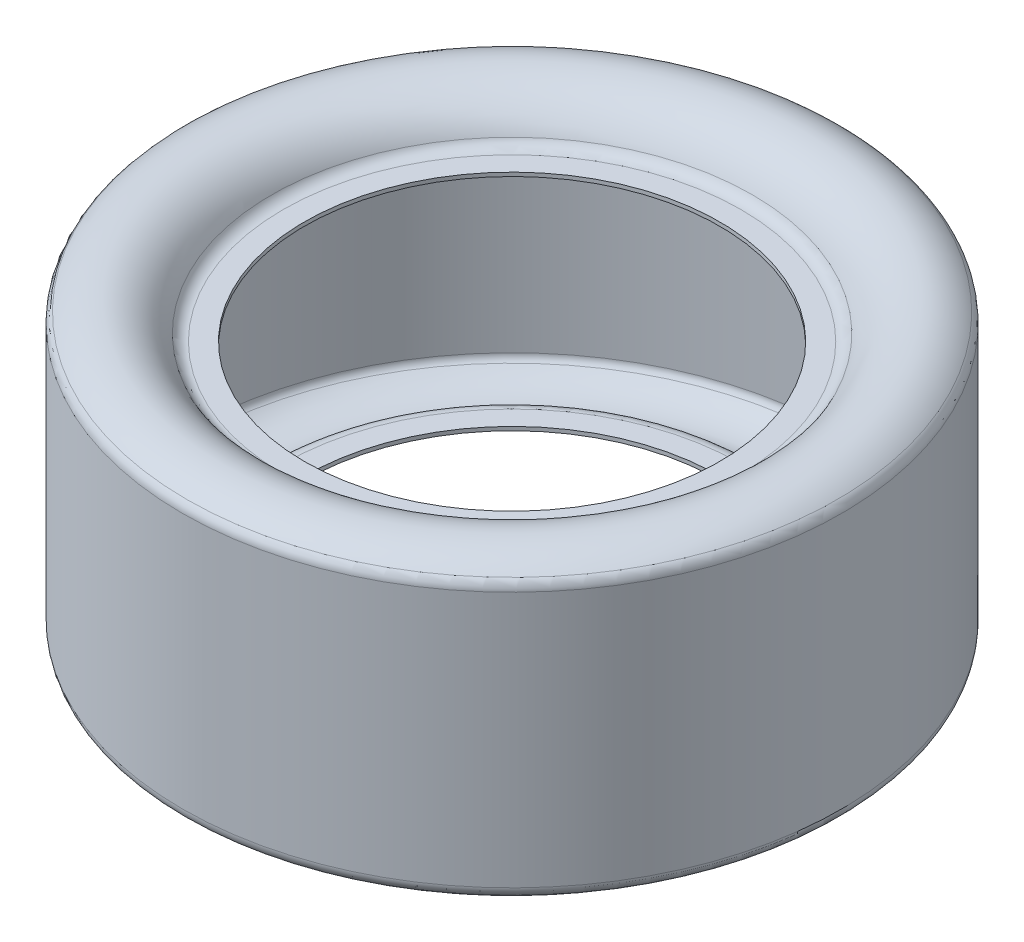
ISO-10303-21;
HEADER;
FILE_DESCRIPTION(('STEP AP214'),'2;1');
FILE_NAME('part.step','',(''),(''),'','','');
FILE_SCHEMA(('AUTOMOTIVE_DESIGN { 1 0 10303 214 1 1 1 1 }'));
ENDSEC;
DATA;
#1=APPLICATION_CONTEXT('core data for automotive mechanical design processes');
#2=APPLICATION_PROTOCOL_DEFINITION('international standard','automotive_design',2000,#1);
#3=PRODUCT_CONTEXT('',#1,'mechanical');
#4=PRODUCT('Part','Part','',(#3));
#5=PRODUCT_RELATED_PRODUCT_CATEGORY('part','',(#4));
#6=PRODUCT_DEFINITION_FORMATION('','',#4);
#7=PRODUCT_DEFINITION_CONTEXT('part definition',#1,'design');
#8=PRODUCT_DEFINITION('design','',#6,#7);
#9=PRODUCT_DEFINITION_SHAPE('','',#8);
#10=(LENGTH_UNIT() NAMED_UNIT(*) SI_UNIT(.MILLI.,.METRE.));
#11=(NAMED_UNIT(*) PLANE_ANGLE_UNIT() SI_UNIT($,.RADIAN.));
#12=(NAMED_UNIT(*) SI_UNIT($,.STERADIAN.) SOLID_ANGLE_UNIT());
#13=UNCERTAINTY_MEASURE_WITH_UNIT(LENGTH_MEASURE(1.E-05),#10,'distance_accuracy_value','');
#14=(GEOMETRIC_REPRESENTATION_CONTEXT(3) GLOBAL_UNCERTAINTY_ASSIGNED_CONTEXT((#13)) GLOBAL_UNIT_ASSIGNED_CONTEXT((#10,
#11,#12)) REPRESENTATION_CONTEXT('',''));
#15=CARTESIAN_POINT('',(0.,0.,0.));
#16=DIRECTION('',(0.,0.,1.));
#17=DIRECTION('',(1.,0.,0.));
#18=AXIS2_PLACEMENT_3D('',#15,#16,#17);
#19=CARTESIAN_POINT('',(0.,-50.8,0.));
#20=DIRECTION('',(0.,1.,0.));
#21=DIRECTION('',(0.,0.,1.));
#22=AXIS2_PLACEMENT_3D('',#19,#20,#21);
#23=CYLINDRICAL_SURFACE('',#22,258.62);
#24=CARTESIAN_POINT('',(0.,-101.6,0.));
#25=DIRECTION('',(0.,1.,0.));
#26=DIRECTION('',(0.,0.,1.));
#27=AXIS2_PLACEMENT_3D('',#24,#25,#26);
#28=CIRCLE('',#27,258.62);
#29=CARTESIAN_POINT('',(0.,-101.6,258.62));
#30=VERTEX_POINT('',#29);
#31=EDGE_CURVE('E241',#30,#30,#28,.F.);
#32=ORIENTED_EDGE('',*,*,#31,.T.);
#33=EDGE_LOOP('',(#32));
#34=FACE_BOUND('',#33,.T.);
#35=CARTESIAN_POINT('',(0.,101.6,0.));
#36=DIRECTION('',(0.,1.,0.));
#37=DIRECTION('',(0.,0.,1.));
#38=AXIS2_PLACEMENT_3D('',#35,#36,#37);
#39=CIRCLE('',#38,258.62);
#40=CARTESIAN_POINT('',(0.,101.6,258.62));
#41=VERTEX_POINT('',#40);
#42=EDGE_CURVE('E238',#41,#41,#39,.T.);
#43=ORIENTED_EDGE('',*,*,#42,.T.);
#44=EDGE_LOOP('',(#43));
#45=FACE_BOUND('',#44,.T.);
#46=ADVANCED_FACE('F14',(#34,#45),#23,.F.);
#47=CARTESIAN_POINT('',(0.,-101.6,0.));
#48=DIRECTION('',(0.,1.,0.));
#49=DIRECTION('',(0.,0.,1.));
#50=AXIS2_PLACEMENT_3D('',#47,#48,#49);
#51=TOROIDAL_SURFACE('',#50,251.62,6.9999999999999);
#52=ORIENTED_EDGE('',*,*,#31,.F.);
#53=EDGE_LOOP('',(#52));
#54=FACE_BOUND('',#53,.T.);
#55=CARTESIAN_POINT('',(0.,-106.98241227044,0.));
#56=DIRECTION('',(0.,1.,0.));
#57=DIRECTION('',(0.,0.,1.));
#58=AXIS2_PLACEMENT_3D('',#55,#56,#57);
#59=CIRCLE('',#58,256.095448374299);
#60=CARTESIAN_POINT('',(0.,-106.98241227044,256.095448374299));
#61=VERTEX_POINT('',#60);
#62=EDGE_CURVE('E219',#61,#61,#59,.F.);
#63=ORIENTED_EDGE('',*,*,#62,.T.);
#64=EDGE_LOOP('',(#63));
#65=FACE_BOUND('',#64,.T.);
#66=ADVANCED_FACE('F232',(#54,#65),#51,.F.);
#67=CARTESIAN_POINT('',(0.,101.6,0.));
#68=DIRECTION('',(0.,1.,0.));
#69=DIRECTION('',(0.,0.,1.));
#70=AXIS2_PLACEMENT_3D('',#67,#68,#69);
#71=TOROIDAL_SURFACE('',#70,251.62,6.9999999999999);
#72=CARTESIAN_POINT('',(0.,106.98241227044,0.));
#73=DIRECTION('',(0.,1.,0.));
#74=DIRECTION('',(0.,0.,1.));
#75=AXIS2_PLACEMENT_3D('',#72,#73,#74);
#76=CIRCLE('',#75,256.095448374299);
#77=CARTESIAN_POINT('',(0.,106.98241227044,256.095448374299));
#78=VERTEX_POINT('',#77);
#79=EDGE_CURVE('E216',#78,#78,#76,.T.);
#80=ORIENTED_EDGE('',*,*,#79,.T.);
#81=EDGE_LOOP('',(#80));
#82=FACE_BOUND('',#81,.T.);
#83=ORIENTED_EDGE('',*,*,#42,.F.);
#84=EDGE_LOOP('',(#83));
#85=FACE_BOUND('',#84,.T.);
#86=ADVANCED_FACE('F228',(#82,#85),#71,.F.);
#87=CARTESIAN_POINT('',(0.,-75.7125833864919,0.));
#88=DIRECTION('',(0.,1.,0.));
#89=DIRECTION('',(0.,0.,1.));
#90=AXIS2_PLACEMENT_3D('',#87,#88,#89);
#91=TOROIDAL_SURFACE('',#90,230.094745007174,40.667416613508);
#92=ORIENTED_EDGE('',*,*,#62,.F.);
#93=EDGE_LOOP('',(#92));
#94=FACE_BOUND('',#93,.T.);
#95=CARTESIAN_POINT('',(0.,-93.2832508625029,0.));
#96=DIRECTION('',(0.,1.,0.));
#97=DIRECTION('',(0.,0.,1.));
#98=AXIS2_PLACEMENT_3D('',#95,#96,#97);
#99=CIRCLE('',#98,193.418998000956);
#100=CARTESIAN_POINT('',(0.,-93.2832508625029,193.418998000956));
#101=VERTEX_POINT('',#100);
#102=EDGE_CURVE('E180',#101,#101,#99,.T.);
#103=ORIENTED_EDGE('',*,*,#102,.F.);
#104=EDGE_LOOP('',(#103));
#105=FACE_BOUND('',#104,.T.);
#106=ADVANCED_FACE('F225',(#94,#105),#91,.F.);
#107=CARTESIAN_POINT('',(0.,75.712583386492,0.));
#108=DIRECTION('',(0.,1.,0.));
#109=DIRECTION('',(0.,0.,1.));
#110=AXIS2_PLACEMENT_3D('',#107,#108,#109);
#111=TOROIDAL_SURFACE('',#110,230.094745007174,40.667416613508);
#112=CARTESIAN_POINT('',(0.,93.283250862503,0.));
#113=DIRECTION('',(0.,1.,0.));
#114=DIRECTION('',(0.,0.,1.));
#115=AXIS2_PLACEMENT_3D('',#112,#113,#114);
#116=CIRCLE('',#115,193.418998000956);
#117=CARTESIAN_POINT('',(0.,93.283250862503,193.418998000956));
#118=VERTEX_POINT('',#117);
#119=EDGE_CURVE('E176',#118,#118,#116,.F.);
#120=ORIENTED_EDGE('',*,*,#119,.F.);
#121=EDGE_LOOP('',(#120));
#122=FACE_BOUND('',#121,.T.);
#123=ORIENTED_EDGE('',*,*,#79,.F.);
#124=EDGE_LOOP('',(#123));
#125=FACE_BOUND('',#124,.T.);
#126=ADVANCED_FACE('F200',(#122,#125),#111,.F.);
#127=CARTESIAN_POINT('',(0.,-98.9,0.));
#128=DIRECTION('',(0.,1.,0.));
#129=DIRECTION('',(0.,0.,1.));
#130=AXIS2_PLACEMENT_3D('',#127,#128,#129);
#131=TOROIDAL_SURFACE('',#130,181.695,13.0000000000001);
#132=ORIENTED_EDGE('',*,*,#102,.T.);
#133=EDGE_LOOP('',(#132));
#134=FACE_BOUND('',#133,.T.);
#135=CARTESIAN_POINT('',(0.,-85.8999999999999,0.));
#136=DIRECTION('',(0.,-1.,0.));
#137=DIRECTION('',(0.,0.,-1.));
#138=AXIS2_PLACEMENT_3D('',#135,#136,#137);
#139=CIRCLE('',#138,181.695000000036);
#140=CARTESIAN_POINT('',(0.,-85.8999999999999,-181.695000000036));
#141=VERTEX_POINT('',#140);
#142=EDGE_CURVE('E179',#141,#141,#139,.F.);
#143=ORIENTED_EDGE('',*,*,#142,.F.);
#144=EDGE_LOOP('',(#143));
#145=FACE_BOUND('',#144,.T.);
#146=ADVANCED_FACE('F196',(#134,#145),#131,.T.);
#147=CARTESIAN_POINT('',(0.,98.9,0.));
#148=DIRECTION('',(0.,1.,0.));
#149=DIRECTION('',(0.,0.,1.));
#150=AXIS2_PLACEMENT_3D('',#147,#148,#149);
#151=TOROIDAL_SURFACE('',#150,181.695,13.0000000000001);
#152=CARTESIAN_POINT('',(0.,85.8999999999999,0.));
#153=DIRECTION('',(0.,1.,0.));
#154=DIRECTION('',(0.,0.,-1.));
#155=AXIS2_PLACEMENT_3D('',#152,#153,#154);
#156=CIRCLE('',#155,181.695000000036);
#157=CARTESIAN_POINT('',(0.,85.8999999999999,-181.695000000036));
#158=VERTEX_POINT('',#157);
#159=EDGE_CURVE('E140',#158,#158,#156,.F.);
#160=ORIENTED_EDGE('',*,*,#159,.F.);
#161=EDGE_LOOP('',(#160));
#162=FACE_BOUND('',#161,.T.);
#163=ORIENTED_EDGE('',*,*,#119,.T.);
#164=EDGE_LOOP('',(#163));
#165=FACE_BOUND('',#164,.T.);
#166=ADVANCED_FACE('F162',(#162,#165),#151,.T.);
#167=CARTESIAN_POINT('',(0.,-85.8999999999999,-164.825));
#168=DIRECTION('',(0.,1.,0.));
#169=DIRECTION('',(0.,0.,1.));
#170=AXIS2_PLACEMENT_3D('',#167,#168,#169);
#171=PLANE('',#170);
#172=CARTESIAN_POINT('',(0.,-85.8999999999999,0.));
#173=DIRECTION('',(0.,1.,0.));
#174=DIRECTION('',(0.,0.,1.));
#175=AXIS2_PLACEMENT_3D('',#172,#173,#174);
#176=CIRCLE('',#175,164.825);
#177=CARTESIAN_POINT('',(0.,-85.8999999999999,164.825));
#178=VERTEX_POINT('',#177);
#179=EDGE_CURVE('E17',#178,#178,#176,.F.);
#180=ORIENTED_EDGE('',*,*,#179,.T.);
#181=EDGE_LOOP('',(#180));
#182=FACE_BOUND('',#181,.T.);
#183=ORIENTED_EDGE('',*,*,#142,.T.);
#184=EDGE_LOOP('',(#183));
#185=FACE_BOUND('',#184,.T.);
#186=ADVANCED_FACE('F157',(#182,#185),#171,.T.);
#187=CARTESIAN_POINT('',(0.,85.9,-181.695000000036));
#188=DIRECTION('',(0.,-1.,0.));
#189=DIRECTION('',(0.,0.,-1.));
#190=AXIS2_PLACEMENT_3D('',#187,#188,#189);
#191=PLANE('',#190);
#192=CARTESIAN_POINT('',(0.,85.8999999999999,0.));
#193=DIRECTION('',(0.,1.,0.));
#194=DIRECTION('',(0.,0.,1.));
#195=AXIS2_PLACEMENT_3D('',#192,#193,#194);
#196=CIRCLE('',#195,164.825);
#197=CARTESIAN_POINT('',(0.,85.8999999999999,164.825));
#198=VERTEX_POINT('',#197);
#199=EDGE_CURVE('E254',#198,#198,#196,.T.);
#200=ORIENTED_EDGE('',*,*,#199,.T.);
#201=EDGE_LOOP('',(#200));
#202=FACE_BOUND('',#201,.T.);
#203=ORIENTED_EDGE('',*,*,#159,.T.);
#204=EDGE_LOOP('',(#203));
#205=FACE_BOUND('',#204,.T.);
#206=ADVANCED_FACE('F147',(#202,#205),#191,.T.);
#207=CARTESIAN_POINT('',(0.,-87.3999999999999,0.));
#208=DIRECTION('',(0.,1.,0.));
#209=DIRECTION('',(0.,0.,1.));
#210=AXIS2_PLACEMENT_3D('',#207,#208,#209);
#211=CYLINDRICAL_SURFACE('',#210,164.825);
#212=ORIENTED_EDGE('',*,*,#179,.F.);
#213=EDGE_LOOP('',(#212));
#214=FACE_BOUND('',#213,.T.);
#215=CARTESIAN_POINT('',(0.,-88.9,0.));
#216=DIRECTION('',(0.,1.,0.));
#217=DIRECTION('',(0.,0.,1.));
#218=AXIS2_PLACEMENT_3D('',#215,#216,#217);
#219=CIRCLE('',#218,164.825);
#220=CARTESIAN_POINT('',(0.,-88.9,164.825));
#221=VERTEX_POINT('',#220);
#222=EDGE_CURVE('E252',#221,#221,#219,.T.);
#223=ORIENTED_EDGE('',*,*,#222,.F.);
#224=EDGE_LOOP('',(#223));
#225=FACE_BOUND('',#224,.T.);
#226=ADVANCED_FACE('F156',(#214,#225),#211,.F.);
#227=CARTESIAN_POINT('',(0.,87.3999999999999,0.));
#228=DIRECTION('',(0.,1.,0.));
#229=DIRECTION('',(0.,0.,1.));
#230=AXIS2_PLACEMENT_3D('',#227,#228,#229);
#231=CYLINDRICAL_SURFACE('',#230,164.825);
#232=CARTESIAN_POINT('',(0.,88.9,0.));
#233=DIRECTION('',(0.,1.,0.));
#234=DIRECTION('',(0.,0.,1.));
#235=AXIS2_PLACEMENT_3D('',#232,#233,#234);
#236=CIRCLE('',#235,164.825);
#237=CARTESIAN_POINT('',(0.,88.9,164.825));
#238=VERTEX_POINT('',#237);
#239=EDGE_CURVE('E249',#238,#238,#236,.F.);
#240=ORIENTED_EDGE('',*,*,#239,.F.);
#241=EDGE_LOOP('',(#240));
#242=FACE_BOUND('',#241,.T.);
#243=ORIENTED_EDGE('',*,*,#199,.F.);
#244=EDGE_LOOP('',(#243));
#245=FACE_BOUND('',#244,.T.);
#246=ADVANCED_FACE('F110',(#242,#245),#231,.F.);
#247=CARTESIAN_POINT('',(0.,-88.9,-181.695));
#248=DIRECTION('',(0.,-1.,0.));
#249=DIRECTION('',(0.,0.,-1.));
#250=AXIS2_PLACEMENT_3D('',#247,#248,#249);
#251=PLANE('',#250);
#252=ORIENTED_EDGE('',*,*,#222,.T.);
#253=EDGE_LOOP('',(#252));
#254=FACE_BOUND('',#253,.T.);
#255=CARTESIAN_POINT('',(0.,-88.9,0.));
#256=DIRECTION('',(0.,1.,0.));
#257=DIRECTION('',(0.,0.,-1.));
#258=AXIS2_PLACEMENT_3D('',#255,#256,#257);
#259=CIRCLE('',#258,181.695);
#260=CARTESIAN_POINT('',(0.,-88.9,-181.695));
#261=VERTEX_POINT('',#260);
#262=EDGE_CURVE('E127',#261,#261,#259,.F.);
#263=ORIENTED_EDGE('',*,*,#262,.T.);
#264=EDGE_LOOP('',(#263));
#265=FACE_BOUND('',#264,.T.);
#266=ADVANCED_FACE('F105',(#254,#265),#251,.T.);
#267=CARTESIAN_POINT('',(0.,88.9,-164.825));
#268=DIRECTION('',(0.,1.,0.));
#269=DIRECTION('',(0.,0.,1.));
#270=AXIS2_PLACEMENT_3D('',#267,#268,#269);
#271=PLANE('',#270);
#272=ORIENTED_EDGE('',*,*,#239,.T.);
#273=EDGE_LOOP('',(#272));
#274=FACE_BOUND('',#273,.T.);
#275=CARTESIAN_POINT('',(0.,88.9,0.));
#276=DIRECTION('',(0.,-1.,0.));
#277=DIRECTION('',(0.,0.,-1.));
#278=AXIS2_PLACEMENT_3D('',#275,#276,#277);
#279=CIRCLE('',#278,181.695);
#280=CARTESIAN_POINT('',(0.,88.9,-181.695));
#281=VERTEX_POINT('',#280);
#282=EDGE_CURVE('E92',#281,#281,#279,.F.);
#283=ORIENTED_EDGE('',*,*,#282,.T.);
#284=EDGE_LOOP('',(#283));
#285=FACE_BOUND('',#284,.T.);
#286=ADVANCED_FACE('F96',(#274,#285),#271,.T.);
#287=CARTESIAN_POINT('',(0.,-98.9,0.));
#288=DIRECTION('',(0.,1.,0.));
#289=DIRECTION('',(0.,0.,1.));
#290=AXIS2_PLACEMENT_3D('',#287,#288,#289);
#291=TOROIDAL_SURFACE('',#290,181.695,10.);
#292=ORIENTED_EDGE('',*,*,#262,.F.);
#293=EDGE_LOOP('',(#292));
#294=FACE_BOUND('',#293,.T.);
#295=CARTESIAN_POINT('',(0.,-94.5794237403871,0.));
#296=DIRECTION('',(0.,1.,0.));
#297=DIRECTION('',(0.,0.,1.));
#298=AXIS2_PLACEMENT_3D('',#295,#296,#297);
#299=CIRCLE('',#298,190.713460000736);
#300=CARTESIAN_POINT('',(0.,-94.5794237403871,190.713460000736));
#301=VERTEX_POINT('',#300);
#302=EDGE_CURVE('E63',#301,#301,#299,.T.);
#303=ORIENTED_EDGE('',*,*,#302,.F.);
#304=EDGE_LOOP('',(#303));
#305=FACE_BOUND('',#304,.T.);
#306=ADVANCED_FACE('F78',(#294,#305),#291,.F.);
#307=CARTESIAN_POINT('',(0.,98.9,0.));
#308=DIRECTION('',(0.,1.,0.));
#309=DIRECTION('',(0.,0.,1.));
#310=AXIS2_PLACEMENT_3D('',#307,#308,#309);
#311=TOROIDAL_SURFACE('',#310,181.695,10.);
#312=CARTESIAN_POINT('',(0.,94.5794237403872,0.));
#313=DIRECTION('',(0.,1.,0.));
#314=DIRECTION('',(0.,0.,1.));
#315=AXIS2_PLACEMENT_3D('',#312,#313,#314);
#316=CIRCLE('',#315,190.713460000736);
#317=CARTESIAN_POINT('',(0.,94.5794237403872,190.713460000736));
#318=VERTEX_POINT('',#317);
#319=EDGE_CURVE('E57',#318,#318,#316,.F.);
#320=ORIENTED_EDGE('',*,*,#319,.F.);
#321=EDGE_LOOP('',(#320));
#322=FACE_BOUND('',#321,.T.);
#323=ORIENTED_EDGE('',*,*,#282,.F.);
#324=EDGE_LOOP('',(#323));
#325=FACE_BOUND('',#324,.T.);
#326=ADVANCED_FACE('F72',(#322,#325),#311,.F.);
#327=CARTESIAN_POINT('',(0.,-75.7125833864919,0.));
#328=DIRECTION('',(0.,1.,0.));
#329=DIRECTION('',(0.,0.,1.));
#330=AXIS2_PLACEMENT_3D('',#327,#328,#329);
#331=TOROIDAL_SURFACE('',#330,230.094745007174,43.667416613508);
#332=ORIENTED_EDGE('',*,*,#302,.T.);
#333=EDGE_LOOP('',(#332));
#334=FACE_BOUND('',#333,.T.);
#335=CARTESIAN_POINT('',(0.,-109.289160386343,0.));
#336=DIRECTION('',(0.,1.,0.));
#337=DIRECTION('',(0.,0.,1.));
#338=AXIS2_PLACEMENT_3D('',#335,#336,#337);
#339=CIRCLE('',#338,258.01349767757);
#340=CARTESIAN_POINT('',(0.,-109.289160386343,258.01349767757));
#341=VERTEX_POINT('',#340);
#342=EDGE_CURVE('E54',#341,#341,#339,.T.);
#343=ORIENTED_EDGE('',*,*,#342,.F.);
#344=EDGE_LOOP('',(#343));
#345=FACE_BOUND('',#344,.T.);
#346=ADVANCED_FACE('F69',(#334,#345),#331,.T.);
#347=CARTESIAN_POINT('',(0.,75.712583386492,0.));
#348=DIRECTION('',(0.,1.,0.));
#349=DIRECTION('',(0.,0.,1.));
#350=AXIS2_PLACEMENT_3D('',#347,#348,#349);
#351=TOROIDAL_SURFACE('',#350,230.094745007174,43.667416613508);
#352=CARTESIAN_POINT('',(0.,109.289160386343,0.));
#353=DIRECTION('',(0.,1.,0.));
#354=DIRECTION('',(0.,0.,1.));
#355=AXIS2_PLACEMENT_3D('',#352,#353,#354);
#356=CIRCLE('',#355,258.01349767757);
#357=CARTESIAN_POINT('',(0.,109.289160386343,258.01349767757));
#358=VERTEX_POINT('',#357);
#359=EDGE_CURVE('E26',#358,#358,#356,.F.);
#360=ORIENTED_EDGE('',*,*,#359,.F.);
#361=EDGE_LOOP('',(#360));
#362=FACE_BOUND('',#361,.T.);
#363=ORIENTED_EDGE('',*,*,#319,.T.);
#364=EDGE_LOOP('',(#363));
#365=FACE_BOUND('',#364,.T.);
#366=ADVANCED_FACE('F47',(#362,#365),#351,.T.);
#367=CARTESIAN_POINT('',(0.,-101.6,0.));
#368=DIRECTION('',(0.,1.,0.));
#369=DIRECTION('',(0.,0.,1.));
#370=AXIS2_PLACEMENT_3D('',#367,#368,#369);
#371=TOROIDAL_SURFACE('',#370,251.62,10.);
#372=ORIENTED_EDGE('',*,*,#342,.T.);
#373=EDGE_LOOP('',(#372));
#374=FACE_BOUND('',#373,.T.);
#375=CARTESIAN_POINT('',(0.,-101.6,0.));
#376=DIRECTION('',(0.,1.,0.));
#377=DIRECTION('',(0.,0.,1.));
#378=AXIS2_PLACEMENT_3D('',#375,#376,#377);
#379=CIRCLE('',#378,261.62);
#380=CARTESIAN_POINT('',(0.,-101.6,261.62));
#381=VERTEX_POINT('',#380);
#382=EDGE_CURVE('E21',#381,#381,#379,.T.);
#383=ORIENTED_EDGE('',*,*,#382,.F.);
#384=EDGE_LOOP('',(#383));
#385=FACE_BOUND('',#384,.T.);
#386=ADVANCED_FACE('F42',(#374,#385),#371,.T.);
#387=CARTESIAN_POINT('',(0.,101.6,0.));
#388=DIRECTION('',(0.,1.,0.));
#389=DIRECTION('',(0.,0.,1.));
#390=AXIS2_PLACEMENT_3D('',#387,#388,#389);
#391=TOROIDAL_SURFACE('',#390,251.62,10.);
#392=CARTESIAN_POINT('',(0.,101.6,0.));
#393=DIRECTION('',(0.,1.,0.));
#394=DIRECTION('',(0.,0.,1.));
#395=AXIS2_PLACEMENT_3D('',#392,#393,#394);
#396=CIRCLE('',#395,261.62);
#397=CARTESIAN_POINT('',(0.,101.6,261.62));
#398=VERTEX_POINT('',#397);
#399=EDGE_CURVE('E10',#398,#398,#396,.F.);
#400=ORIENTED_EDGE('',*,*,#399,.F.);
#401=EDGE_LOOP('',(#400));
#402=FACE_BOUND('',#401,.T.);
#403=ORIENTED_EDGE('',*,*,#359,.T.);
#404=EDGE_LOOP('',(#403));
#405=FACE_BOUND('',#404,.T.);
#406=ADVANCED_FACE('F37',(#402,#405),#391,.T.);
#407=CARTESIAN_POINT('',(0.,50.8,0.));
#408=DIRECTION('',(0.,1.,0.));
#409=DIRECTION('',(0.,0.,1.));
#410=AXIS2_PLACEMENT_3D('',#407,#408,#409);
#411=CYLINDRICAL_SURFACE('',#410,261.62);
#412=ORIENTED_EDGE('',*,*,#399,.T.);
#413=EDGE_LOOP('',(#412));
#414=FACE_BOUND('',#413,.T.);
#415=ORIENTED_EDGE('',*,*,#382,.T.);
#416=EDGE_LOOP('',(#415));
#417=FACE_BOUND('',#416,.T.);
#418=ADVANCED_FACE('F41',(#414,#417),#411,.T.);
#419=CLOSED_SHELL('',(#46,#66,#86,#106,#126,#146,#166,#186,#206,#226,#246,#266,#286,#306,#326,
#346,#366,#386,#406,#418));
#420=MANIFOLD_SOLID_BREP('B1',#419);
#421=ADVANCED_BREP_SHAPE_REPRESENTATION('',(#18,#420),#14);
#422=SHAPE_DEFINITION_REPRESENTATION(#9,#421);
ENDSEC;
END-ISO-10303-21;
